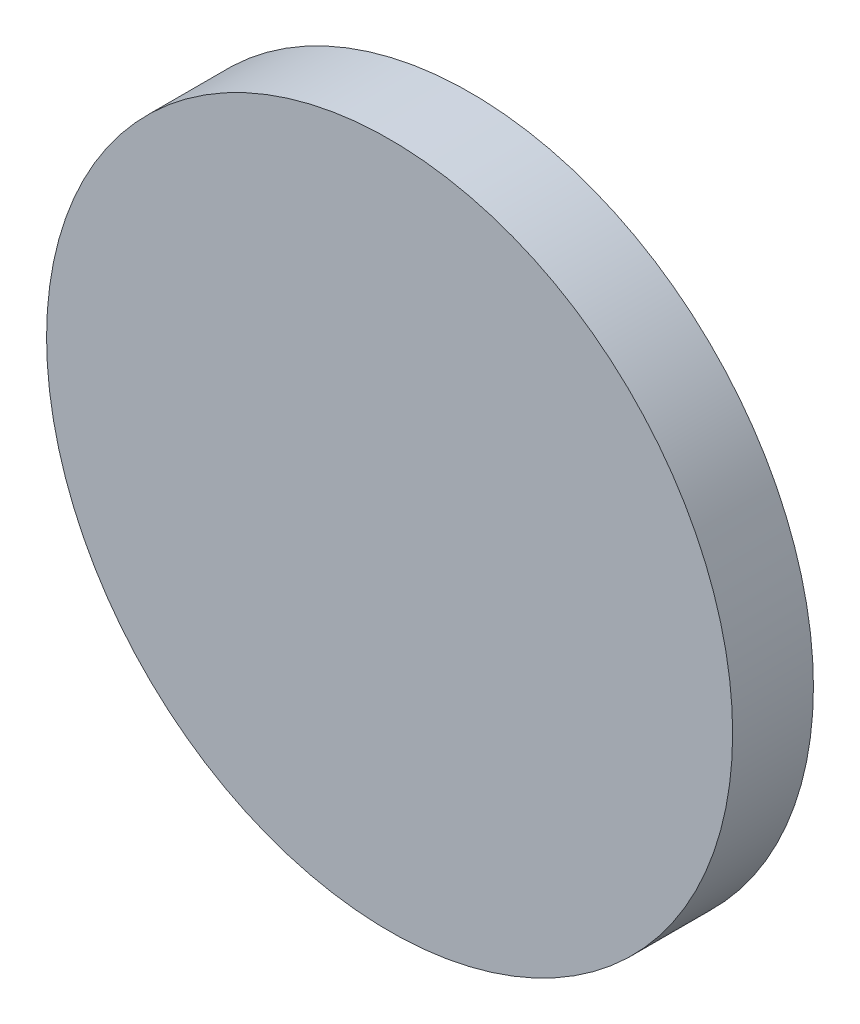
ISO-10303-21;
HEADER;
FILE_DESCRIPTION(('STEP AP214'),'2;1');
FILE_NAME('part.step','',(''),(''),'','','');
FILE_SCHEMA(('AUTOMOTIVE_DESIGN { 1 0 10303 214 1 1 1 1 }'));
ENDSEC;
DATA;
#1=APPLICATION_CONTEXT('core data for automotive mechanical design processes');
#2=APPLICATION_PROTOCOL_DEFINITION('international standard','automotive_design',2000,#1);
#3=PRODUCT_CONTEXT('',#1,'mechanical');
#4=PRODUCT('Part','Part','',(#3));
#5=PRODUCT_RELATED_PRODUCT_CATEGORY('part','',(#4));
#6=PRODUCT_DEFINITION_FORMATION('','',#4);
#7=PRODUCT_DEFINITION_CONTEXT('part definition',#1,'design');
#8=PRODUCT_DEFINITION('design','',#6,#7);
#9=PRODUCT_DEFINITION_SHAPE('','',#8);
#10=(LENGTH_UNIT() NAMED_UNIT(*) SI_UNIT(.MILLI.,.METRE.));
#11=(NAMED_UNIT(*) PLANE_ANGLE_UNIT() SI_UNIT($,.RADIAN.));
#12=(NAMED_UNIT(*) SI_UNIT($,.STERADIAN.) SOLID_ANGLE_UNIT());
#13=UNCERTAINTY_MEASURE_WITH_UNIT(LENGTH_MEASURE(1.E-05),#10,'distance_accuracy_value','');
#14=(GEOMETRIC_REPRESENTATION_CONTEXT(3) GLOBAL_UNCERTAINTY_ASSIGNED_CONTEXT((#13)) GLOBAL_UNIT_ASSIGNED_CONTEXT((#10,
#11,#12)) REPRESENTATION_CONTEXT('',''));
#15=CARTESIAN_POINT('',(0.,0.,0.));
#16=DIRECTION('',(0.,0.,1.));
#17=DIRECTION('',(1.,0.,0.));
#18=AXIS2_PLACEMENT_3D('',#15,#16,#17);
#19=CARTESIAN_POINT('',(0.,0.,6.));
#20=DIRECTION('',(0.,0.,-1.));
#21=DIRECTION('',(-1.,0.,0.));
#22=AXIS2_PLACEMENT_3D('',#19,#20,#21);
#23=CYLINDRICAL_SURFACE('',#22,25.48);
#24=CARTESIAN_POINT('',(0.,0.,6.));
#25=DIRECTION('',(0.,0.,1.));
#26=DIRECTION('',(1.,0.,0.));
#27=AXIS2_PLACEMENT_3D('',#24,#25,#26);
#28=CIRCLE('',#27,25.48);
#29=CARTESIAN_POINT('',(25.48,0.,6.));
#30=VERTEX_POINT('',#29);
#31=EDGE_CURVE('E68',#30,#30,#28,.T.);
#32=ORIENTED_EDGE('',*,*,#31,.F.);
#33=EDGE_LOOP('',(#32));
#34=FACE_BOUND('',#33,.T.);
#35=CARTESIAN_POINT('',(0.,0.,0.));
#36=DIRECTION('',(0.,0.,1.));
#37=DIRECTION('',(1.,0.,0.));
#38=AXIS2_PLACEMENT_3D('',#35,#36,#37);
#39=CIRCLE('',#38,25.48);
#40=CARTESIAN_POINT('',(25.48,0.,0.));
#41=VERTEX_POINT('',#40);
#42=EDGE_CURVE('E69',#41,#41,#39,.T.);
#43=ORIENTED_EDGE('',*,*,#42,.T.);
#44=EDGE_LOOP('',(#43));
#45=FACE_BOUND('',#44,.T.);
#46=ADVANCED_FACE('F37',(#34,#45),#23,.T.);
#47=CARTESIAN_POINT('',(0.,0.,6.));
#48=DIRECTION('',(0.,0.,1.));
#49=DIRECTION('',(1.,0.,0.));
#50=AXIS2_PLACEMENT_3D('',#47,#48,#49);
#51=PLANE('',#50);
#52=ORIENTED_EDGE('',*,*,#31,.T.);
#53=EDGE_LOOP('',(#52));
#54=FACE_BOUND('',#53,.T.);
#55=ADVANCED_FACE('F116',(#54),#51,.T.);
#56=CARTESIAN_POINT('',(0.,0.,0.));
#57=DIRECTION('',(0.,0.,1.));
#58=DIRECTION('',(1.,0.,0.));
#59=AXIS2_PLACEMENT_3D('',#56,#57,#58);
#60=PLANE('',#59);
#61=CARTESIAN_POINT('',(11.6233027970143,6.71071699872842,0.));
#62=DIRECTION('',(0.,0.,1.));
#63=DIRECTION('',(1.,0.,0.));
#64=AXIS2_PLACEMENT_3D('',#61,#62,#63);
#65=CIRCLE('',#64,2.00000000000069);
#66=CARTESIAN_POINT('',(13.623302797015,6.71071699872842,0.));
#67=VERTEX_POINT('',#66);
#68=EDGE_CURVE('E10',#67,#67,#65,.F.);
#69=ORIENTED_EDGE('',*,*,#68,.F.);
#70=EDGE_LOOP('',(#69));
#71=FACE_BOUND('',#70,.T.);
#72=CARTESIAN_POINT('',(11.6233027970138,-6.71071699872942,0.));
#73=DIRECTION('',(0.,0.,1.));
#74=DIRECTION('',(1.,0.,0.));
#75=AXIS2_PLACEMENT_3D('',#72,#73,#74);
#76=CIRCLE('',#75,2.00000000000135);
#77=CARTESIAN_POINT('',(13.6233027970151,-6.71071699872942,0.));
#78=VERTEX_POINT('',#77);
#79=EDGE_CURVE('E44',#78,#78,#76,.F.);
#80=ORIENTED_EDGE('',*,*,#79,.F.);
#81=EDGE_LOOP('',(#80));
#82=FACE_BOUND('',#81,.T.);
#83=CARTESIAN_POINT('',(-1.13944933678979E-12,-13.4214339974578,0.));
#84=DIRECTION('',(0.,0.,1.));
#85=DIRECTION('',(1.,0.,0.));
#86=AXIS2_PLACEMENT_3D('',#83,#84,#85);
#87=CIRCLE('',#86,2.00000000000143);
#88=CARTESIAN_POINT('',(2.00000000000029,-13.4214339974578,0.));
#89=VERTEX_POINT('',#88);
#90=EDGE_CURVE('E49',#89,#89,#87,.F.);
#91=ORIENTED_EDGE('',*,*,#90,.F.);
#92=EDGE_LOOP('',(#91));
#93=FACE_BOUND('',#92,.T.);
#94=CARTESIAN_POINT('',(-11.6233027970155,-6.71071699872843,0.));
#95=DIRECTION('',(0.,0.,1.));
#96=DIRECTION('',(1.,0.,0.));
#97=AXIS2_PLACEMENT_3D('',#94,#95,#96);
#98=CIRCLE('',#97,2.00000000000096);
#99=CARTESIAN_POINT('',(-9.62330279701452,-6.71071699872843,0.));
#100=VERTEX_POINT('',#99);
#101=EDGE_CURVE('E54',#100,#100,#98,.F.);
#102=ORIENTED_EDGE('',*,*,#101,.F.);
#103=EDGE_LOOP('',(#102));
#104=FACE_BOUND('',#103,.T.);
#105=CARTESIAN_POINT('',(-11.6233027970149,6.71071699872942,0.));
#106=DIRECTION('',(0.,0.,1.));
#107=DIRECTION('',(1.,0.,0.));
#108=AXIS2_PLACEMENT_3D('',#105,#106,#107);
#109=CIRCLE('',#108,2.00000000000036);
#110=CARTESIAN_POINT('',(-9.62330279701454,6.71071699872942,0.));
#111=VERTEX_POINT('',#110);
#112=EDGE_CURVE('E60',#111,#111,#109,.F.);
#113=ORIENTED_EDGE('',*,*,#112,.F.);
#114=EDGE_LOOP('',(#113));
#115=FACE_BOUND('',#114,.T.);
#116=CARTESIAN_POINT('',(0.,13.4214339974578,0.));
#117=DIRECTION('',(0.,0.,1.));
#118=DIRECTION('',(1.,0.,0.));
#119=AXIS2_PLACEMENT_3D('',#116,#117,#118);
#120=CIRCLE('',#119,2.);
#121=CARTESIAN_POINT('',(2.,13.4214339974578,0.));
#122=VERTEX_POINT('',#121);
#123=EDGE_CURVE('E64',#122,#122,#120,.F.);
#124=ORIENTED_EDGE('',*,*,#123,.F.);
#125=EDGE_LOOP('',(#124));
#126=FACE_BOUND('',#125,.T.);
#127=ORIENTED_EDGE('',*,*,#42,.F.);
#128=EDGE_LOOP('',(#127));
#129=FACE_BOUND('',#128,.T.);
#130=ADVANCED_FACE('F121',(#71,#82,#93,#104,#115,#126,#129),#60,.F.);
#131=CARTESIAN_POINT('',(0.,13.4214339974578,-2.));
#132=DIRECTION('',(0.,0.,1.));
#133=DIRECTION('',(1.,0.,0.));
#134=AXIS2_PLACEMENT_3D('',#131,#132,#133);
#135=CYLINDRICAL_SURFACE('',#134,2.);
#136=CARTESIAN_POINT('',(0.,13.4214339974578,-2.));
#137=DIRECTION('',(0.,0.,-1.));
#138=DIRECTION('',(-1.,0.,0.));
#139=AXIS2_PLACEMENT_3D('',#136,#137,#138);
#140=CIRCLE('',#139,2.);
#141=CARTESIAN_POINT('',(-2.,13.4214339974578,-2.));
#142=VERTEX_POINT('',#141);
#143=EDGE_CURVE('E73',#142,#142,#140,.T.);
#144=ORIENTED_EDGE('',*,*,#143,.F.);
#145=EDGE_LOOP('',(#144));
#146=FACE_BOUND('',#145,.T.);
#147=ORIENTED_EDGE('',*,*,#123,.T.);
#148=EDGE_LOOP('',(#147));
#149=FACE_BOUND('',#148,.T.);
#150=ADVANCED_FACE('F129',(#146,#149),#135,.T.);
#151=CARTESIAN_POINT('',(0.,13.4214339974578,-2.));
#152=DIRECTION('',(0.,0.,-1.));
#153=DIRECTION('',(-1.,0.,0.));
#154=AXIS2_PLACEMENT_3D('',#151,#152,#153);
#155=PLANE('',#154);
#156=ORIENTED_EDGE('',*,*,#143,.T.);
#157=EDGE_LOOP('',(#156));
#158=FACE_BOUND('',#157,.T.);
#159=ADVANCED_FACE('F134',(#158),#155,.T.);
#160=CARTESIAN_POINT('',(-11.6233027970149,6.71071699872942,-2.));
#161=DIRECTION('',(0.,0.,1.));
#162=DIRECTION('',(1.,0.,0.));
#163=AXIS2_PLACEMENT_3D('',#160,#161,#162);
#164=CYLINDRICAL_SURFACE('',#163,2.00000000000036);
#165=CARTESIAN_POINT('',(-11.6233027970149,6.71071699872942,-2.));
#166=DIRECTION('',(0.,0.,-1.));
#167=DIRECTION('',(-1.,0.,0.));
#168=AXIS2_PLACEMENT_3D('',#165,#166,#167);
#169=CIRCLE('',#168,2.00000000000036);
#170=CARTESIAN_POINT('',(-13.6233027970153,6.71071699872942,-2.));
#171=VERTEX_POINT('',#170);
#172=EDGE_CURVE('E80',#171,#171,#169,.T.);
#173=ORIENTED_EDGE('',*,*,#172,.F.);
#174=EDGE_LOOP('',(#173));
#175=FACE_BOUND('',#174,.T.);
#176=ORIENTED_EDGE('',*,*,#112,.T.);
#177=EDGE_LOOP('',(#176));
#178=FACE_BOUND('',#177,.T.);
#179=ADVANCED_FACE('F141',(#175,#178),#164,.T.);
#180=CARTESIAN_POINT('',(-11.6233027970149,6.71071699872942,-2.));
#181=DIRECTION('',(0.,0.,-1.));
#182=DIRECTION('',(-1.,0.,0.));
#183=AXIS2_PLACEMENT_3D('',#180,#181,#182);
#184=PLANE('',#183);
#185=ORIENTED_EDGE('',*,*,#172,.T.);
#186=EDGE_LOOP('',(#185));
#187=FACE_BOUND('',#186,.T.);
#188=ADVANCED_FACE('F145',(#187),#184,.T.);
#189=CARTESIAN_POINT('',(-11.6233027970155,-6.71071699872843,-2.));
#190=DIRECTION('',(0.,0.,1.));
#191=DIRECTION('',(1.,0.,0.));
#192=AXIS2_PLACEMENT_3D('',#189,#190,#191);
#193=CYLINDRICAL_SURFACE('',#192,2.00000000000096);
#194=CARTESIAN_POINT('',(-11.6233027970155,-6.71071699872843,-2.));
#195=DIRECTION('',(0.,0.,-1.));
#196=DIRECTION('',(-1.,0.,0.));
#197=AXIS2_PLACEMENT_3D('',#194,#195,#196);
#198=CIRCLE('',#197,2.00000000000096);
#199=CARTESIAN_POINT('',(-13.6233027970164,-6.71071699872843,-2.));
#200=VERTEX_POINT('',#199);
#201=EDGE_CURVE('E84',#200,#200,#198,.T.);
#202=ORIENTED_EDGE('',*,*,#201,.F.);
#203=EDGE_LOOP('',(#202));
#204=FACE_BOUND('',#203,.T.);
#205=ORIENTED_EDGE('',*,*,#101,.T.);
#206=EDGE_LOOP('',(#205));
#207=FACE_BOUND('',#206,.T.);
#208=ADVANCED_FACE('F149',(#204,#207),#193,.T.);
#209=CARTESIAN_POINT('',(-11.6233027970155,-6.71071699872843,-2.));
#210=DIRECTION('',(0.,0.,-1.));
#211=DIRECTION('',(-1.,0.,0.));
#212=AXIS2_PLACEMENT_3D('',#209,#210,#211);
#213=PLANE('',#212);
#214=ORIENTED_EDGE('',*,*,#201,.T.);
#215=EDGE_LOOP('',(#214));
#216=FACE_BOUND('',#215,.T.);
#217=ADVANCED_FACE('F153',(#216),#213,.T.);
#218=CARTESIAN_POINT('',(-1.13944933678979E-12,-13.4214339974578,-2.));
#219=DIRECTION('',(0.,0.,1.));
#220=DIRECTION('',(1.,0.,0.));
#221=AXIS2_PLACEMENT_3D('',#218,#219,#220);
#222=CYLINDRICAL_SURFACE('',#221,2.00000000000143);
#223=CARTESIAN_POINT('',(-1.13944933678979E-12,-13.4214339974578,-2.));
#224=DIRECTION('',(0.,0.,-1.));
#225=DIRECTION('',(-1.,0.,0.));
#226=AXIS2_PLACEMENT_3D('',#223,#224,#225);
#227=CIRCLE('',#226,2.00000000000143);
#228=CARTESIAN_POINT('',(-2.00000000000257,-13.4214339974578,-2.));
#229=VERTEX_POINT('',#228);
#230=EDGE_CURVE('E88',#229,#229,#227,.T.);
#231=ORIENTED_EDGE('',*,*,#230,.F.);
#232=EDGE_LOOP('',(#231));
#233=FACE_BOUND('',#232,.T.);
#234=ORIENTED_EDGE('',*,*,#90,.T.);
#235=EDGE_LOOP('',(#234));
#236=FACE_BOUND('',#235,.T.);
#237=ADVANCED_FACE('F157',(#233,#236),#222,.T.);
#238=CARTESIAN_POINT('',(-1.13944933678979E-12,-13.4214339974578,-2.));
#239=DIRECTION('',(0.,0.,-1.));
#240=DIRECTION('',(-1.,0.,0.));
#241=AXIS2_PLACEMENT_3D('',#238,#239,#240);
#242=PLANE('',#241);
#243=ORIENTED_EDGE('',*,*,#230,.T.);
#244=EDGE_LOOP('',(#243));
#245=FACE_BOUND('',#244,.T.);
#246=ADVANCED_FACE('F161',(#245),#242,.T.);
#247=CARTESIAN_POINT('',(11.6233027970138,-6.71071699872942,-2.));
#248=DIRECTION('',(0.,0.,1.));
#249=DIRECTION('',(1.,0.,0.));
#250=AXIS2_PLACEMENT_3D('',#247,#248,#249);
#251=CYLINDRICAL_SURFACE('',#250,2.00000000000135);
#252=CARTESIAN_POINT('',(11.6233027970138,-6.71071699872942,-2.));
#253=DIRECTION('',(0.,0.,-1.));
#254=DIRECTION('',(-1.,0.,0.));
#255=AXIS2_PLACEMENT_3D('',#252,#253,#254);
#256=CIRCLE('',#255,2.00000000000135);
#257=CARTESIAN_POINT('',(9.62330279701241,-6.71071699872942,-2.));
#258=VERTEX_POINT('',#257);
#259=EDGE_CURVE('E92',#258,#258,#256,.T.);
#260=ORIENTED_EDGE('',*,*,#259,.F.);
#261=EDGE_LOOP('',(#260));
#262=FACE_BOUND('',#261,.T.);
#263=ORIENTED_EDGE('',*,*,#79,.T.);
#264=EDGE_LOOP('',(#263));
#265=FACE_BOUND('',#264,.T.);
#266=ADVANCED_FACE('F112',(#262,#265),#251,.T.);
#267=CARTESIAN_POINT('',(11.6233027970138,-6.71071699872942,-2.));
#268=DIRECTION('',(0.,0.,-1.));
#269=DIRECTION('',(-1.,0.,0.));
#270=AXIS2_PLACEMENT_3D('',#267,#268,#269);
#271=PLANE('',#270);
#272=ORIENTED_EDGE('',*,*,#259,.T.);
#273=EDGE_LOOP('',(#272));
#274=FACE_BOUND('',#273,.T.);
#275=ADVANCED_FACE('F105',(#274),#271,.T.);
#276=CARTESIAN_POINT('',(11.6233027970143,6.71071699872842,-2.));
#277=DIRECTION('',(0.,0.,1.));
#278=DIRECTION('',(1.,0.,0.));
#279=AXIS2_PLACEMENT_3D('',#276,#277,#278);
#280=CYLINDRICAL_SURFACE('',#279,2.00000000000069);
#281=CARTESIAN_POINT('',(11.6233027970143,6.71071699872842,-2.));
#282=DIRECTION('',(0.,0.,-1.));
#283=DIRECTION('',(-1.,0.,0.));
#284=AXIS2_PLACEMENT_3D('',#281,#282,#283);
#285=CIRCLE('',#284,2.00000000000069);
#286=CARTESIAN_POINT('',(9.62330279701366,6.71071699872842,-2.));
#287=VERTEX_POINT('',#286);
#288=EDGE_CURVE('E96',#287,#287,#285,.T.);
#289=ORIENTED_EDGE('',*,*,#288,.F.);
#290=EDGE_LOOP('',(#289));
#291=FACE_BOUND('',#290,.T.);
#292=ORIENTED_EDGE('',*,*,#68,.T.);
#293=EDGE_LOOP('',(#292));
#294=FACE_BOUND('',#293,.T.);
#295=ADVANCED_FACE('F103',(#291,#294),#280,.T.);
#296=CARTESIAN_POINT('',(11.6233027970143,6.71071699872842,-2.));
#297=DIRECTION('',(0.,0.,-1.));
#298=DIRECTION('',(-1.,0.,0.));
#299=AXIS2_PLACEMENT_3D('',#296,#297,#298);
#300=PLANE('',#299);
#301=ORIENTED_EDGE('',*,*,#288,.T.);
#302=EDGE_LOOP('',(#301));
#303=FACE_BOUND('',#302,.T.);
#304=ADVANCED_FACE('F101',(#303),#300,.T.);
#305=CLOSED_SHELL('',(#46,#55,#130,#150,#159,#179,#188,#208,#217,#237,#246,#266,#275,#295,#304));
#306=MANIFOLD_SOLID_BREP('B2',#305);
#307=ADVANCED_BREP_SHAPE_REPRESENTATION('',(#18,#306),#14);
#308=SHAPE_DEFINITION_REPRESENTATION(#9,#307);
ENDSEC;
END-ISO-10303-21;
